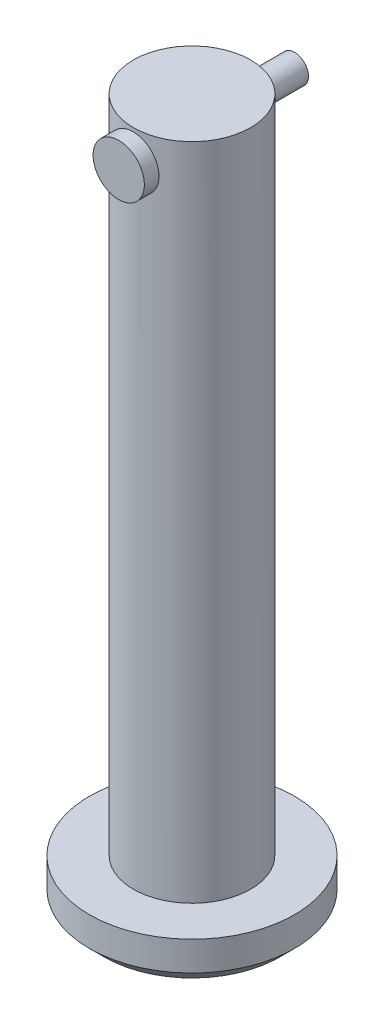
ISO-10303-21;
HEADER;
FILE_DESCRIPTION(('STEP AP214'),'2;1');
FILE_NAME('part.step','',(''),(''),'','','');
FILE_SCHEMA(('AUTOMOTIVE_DESIGN { 1 0 10303 214 1 1 1 1 }'));
ENDSEC;
DATA;
#1=APPLICATION_CONTEXT('core data for automotive mechanical design processes');
#2=APPLICATION_PROTOCOL_DEFINITION('international standard','automotive_design',2000,#1);
#3=PRODUCT_CONTEXT('',#1,'mechanical');
#4=PRODUCT('Part','Part','',(#3));
#5=PRODUCT_RELATED_PRODUCT_CATEGORY('part','',(#4));
#6=PRODUCT_DEFINITION_FORMATION('','',#4);
#7=PRODUCT_DEFINITION_CONTEXT('part definition',#1,'design');
#8=PRODUCT_DEFINITION('design','',#6,#7);
#9=PRODUCT_DEFINITION_SHAPE('','',#8);
#10=(LENGTH_UNIT() NAMED_UNIT(*) SI_UNIT(.MILLI.,.METRE.));
#11=(NAMED_UNIT(*) PLANE_ANGLE_UNIT() SI_UNIT($,.RADIAN.));
#12=(NAMED_UNIT(*) SI_UNIT($,.STERADIAN.) SOLID_ANGLE_UNIT());
#13=UNCERTAINTY_MEASURE_WITH_UNIT(LENGTH_MEASURE(1.E-05),#10,'distance_accuracy_value','');
#14=(GEOMETRIC_REPRESENTATION_CONTEXT(3) GLOBAL_UNCERTAINTY_ASSIGNED_CONTEXT((#13)) GLOBAL_UNIT_ASSIGNED_CONTEXT((#10,
#11,#12)) REPRESENTATION_CONTEXT('',''));
#15=CARTESIAN_POINT('',(0.,0.,0.));
#16=DIRECTION('',(0.,0.,1.));
#17=DIRECTION('',(1.,0.,0.));
#18=AXIS2_PLACEMENT_3D('',#15,#16,#17);
#19=CARTESIAN_POINT('',(0.,43.,-7.));
#20=DIRECTION('',(0.,0.,1.));
#21=DIRECTION('',(1.,0.,0.));
#22=AXIS2_PLACEMENT_3D('',#19,#20,#21);
#23=CYLINDRICAL_SURFACE('',#22,0.95);
#24=CARTESIAN_POINT('',(0.,43.,-7.));
#25=DIRECTION('',(0.,0.,1.));
#26=DIRECTION('',(1.,0.,0.));
#27=AXIS2_PLACEMENT_3D('',#24,#25,#26);
#28=CIRCLE('',#27,0.95);
#29=CARTESIAN_POINT('',(0.95,43.,-7.));
#30=VERTEX_POINT('',#29);
#31=EDGE_CURVE('E11',#30,#30,#28,.T.);
#32=ORIENTED_EDGE('',*,*,#31,.T.);
#33=EDGE_LOOP('',(#32));
#34=FACE_BOUND('',#33,.T.);
#35=CARTESIAN_POINT('',(0.,43.,4.));
#36=DIRECTION('',(0.,0.,1.));
#37=DIRECTION('',(1.,0.,0.));
#38=AXIS2_PLACEMENT_3D('',#35,#36,#37);
#39=CIRCLE('',#38,0.95);
#40=CARTESIAN_POINT('',(0.95,43.,4.));
#41=VERTEX_POINT('',#40);
#42=EDGE_CURVE('E44',#41,#41,#39,.F.);
#43=ORIENTED_EDGE('',*,*,#42,.T.);
#44=EDGE_LOOP('',(#43));
#45=FACE_BOUND('',#44,.T.);
#46=ADVANCED_FACE('F41',(#34,#45),#23,.T.);
#47=CARTESIAN_POINT('',(0.,43.,-7.));
#48=DIRECTION('',(0.,0.,1.));
#49=DIRECTION('',(1.,0.,0.));
#50=AXIS2_PLACEMENT_3D('',#47,#48,#49);
#51=PLANE('',#50);
#52=ORIENTED_EDGE('',*,*,#31,.F.);
#53=EDGE_LOOP('',(#52));
#54=FACE_BOUND('',#53,.T.);
#55=ADVANCED_FACE('F73',(#54),#51,.F.);
#56=CARTESIAN_POINT('',(0.,43.,4.));
#57=DIRECTION('',(0.,0.,1.));
#58=DIRECTION('',(1.,0.,0.));
#59=AXIS2_PLACEMENT_3D('',#56,#57,#58);
#60=CYLINDRICAL_SURFACE('',#59,1.75);
#61=CARTESIAN_POINT('',(0.,43.,4.));
#62=DIRECTION('',(0.,0.,1.));
#63=DIRECTION('',(1.,0.,0.));
#64=AXIS2_PLACEMENT_3D('',#61,#62,#63);
#65=CIRCLE('',#64,1.75);
#66=CARTESIAN_POINT('',(1.75,43.,4.));
#67=VERTEX_POINT('',#66);
#68=EDGE_CURVE('E51',#67,#67,#65,.T.);
#69=ORIENTED_EDGE('',*,*,#68,.T.);
#70=EDGE_LOOP('',(#69));
#71=FACE_BOUND('',#70,.T.);
#72=CARTESIAN_POINT('',(0.,43.,5.));
#73=DIRECTION('',(0.,0.,1.));
#74=DIRECTION('',(1.,0.,0.));
#75=AXIS2_PLACEMENT_3D('',#72,#73,#74);
#76=CIRCLE('',#75,1.75);
#77=CARTESIAN_POINT('',(1.75,43.,5.));
#78=VERTEX_POINT('',#77);
#79=EDGE_CURVE('E53',#78,#78,#76,.T.);
#80=ORIENTED_EDGE('',*,*,#79,.F.);
#81=EDGE_LOOP('',(#80));
#82=FACE_BOUND('',#81,.T.);
#83=ADVANCED_FACE('F59',(#71,#82),#60,.T.);
#84=CARTESIAN_POINT('',(0.,43.,4.));
#85=DIRECTION('',(0.,0.,1.));
#86=DIRECTION('',(1.,0.,0.));
#87=AXIS2_PLACEMENT_3D('',#84,#85,#86);
#88=PLANE('',#87);
#89=ORIENTED_EDGE('',*,*,#42,.F.);
#90=EDGE_LOOP('',(#89));
#91=FACE_BOUND('',#90,.T.);
#92=ORIENTED_EDGE('',*,*,#68,.F.);
#93=EDGE_LOOP('',(#92));
#94=FACE_BOUND('',#93,.T.);
#95=ADVANCED_FACE('F62',(#91,#94),#88,.F.);
#96=CARTESIAN_POINT('',(0.,43.,5.));
#97=DIRECTION('',(0.,0.,1.));
#98=DIRECTION('',(1.,0.,0.));
#99=AXIS2_PLACEMENT_3D('',#96,#97,#98);
#100=PLANE('',#99);
#101=ORIENTED_EDGE('',*,*,#79,.T.);
#102=EDGE_LOOP('',(#101));
#103=FACE_BOUND('',#102,.T.);
#104=ADVANCED_FACE('F64',(#103),#100,.T.);
#105=CLOSED_SHELL('',(#46,#55,#83,#95,#104));
#106=MANIFOLD_SOLID_BREP('B2',#105);
#107=CARTESIAN_POINT('',(0.,45.,0.));
#108=DIRECTION('',(0.,-1.,0.));
#109=DIRECTION('',(0.,0.,-1.));
#110=AXIS2_PLACEMENT_3D('',#107,#108,#109);
#111=CYLINDRICAL_SURFACE('',#110,4.);
#112=CARTESIAN_POINT('',(0.,45.,0.));
#113=DIRECTION('',(0.,1.,0.));
#114=DIRECTION('',(0.,0.,1.));
#115=AXIS2_PLACEMENT_3D('',#112,#113,#114);
#116=CIRCLE('',#115,4.);
#117=CARTESIAN_POINT('',(0.,45.,4.));
#118=VERTEX_POINT('',#117);
#119=EDGE_CURVE('E131',#118,#118,#116,.T.);
#120=ORIENTED_EDGE('',*,*,#119,.F.);
#121=EDGE_LOOP('',(#120));
#122=FACE_BOUND('',#121,.T.);
#123=CARTESIAN_POINT('',(0.,0.,0.));
#124=DIRECTION('',(0.,-1.,0.));
#125=DIRECTION('',(0.,0.,-1.));
#126=AXIS2_PLACEMENT_3D('',#123,#124,#125);
#127=CIRCLE('',#126,4.);
#128=CARTESIAN_POINT('',(0.,0.,-4.));
#129=VERTEX_POINT('',#128);
#130=EDGE_CURVE('E165',#129,#129,#127,.T.);
#131=ORIENTED_EDGE('',*,*,#130,.F.);
#132=EDGE_LOOP('',(#131));
#133=FACE_BOUND('',#132,.T.);
#134=CARTESIAN_POINT('',(-1.,43.,3.87298334620742));
#135=CARTESIAN_POINT('',(-0.9999984314387,42.9447796996432,3.87298440057185));
#136=CARTESIAN_POINT('',(-0.99541049820807,42.8895420405686,3.87417722499278));
#137=CARTESIAN_POINT('',(-0.977209250194448,42.7806529687674,3.87880744892249));
#138=CARTESIAN_POINT('',(-0.963590682698079,42.72700249822,3.8822461547418));
#139=CARTESIAN_POINT('',(-0.927796479849635,42.6228785847122,3.89095489813012));
#140=CARTESIAN_POINT('',(-0.905631891140941,42.5724011378422,3.8962225706936));
#141=CARTESIAN_POINT('',(-0.853408456505403,42.4758756589875,3.90799276818327));
#142=CARTESIAN_POINT('',(-0.823349275424503,42.4298278151688,3.91449534553241));
#143=CARTESIAN_POINT('',(-0.755483370924518,42.3424553418942,3.92816286540368));
#144=CARTESIAN_POINT('',(-0.717534755081558,42.3012425598597,3.93533839048709));
#145=CARTESIAN_POINT('',(-0.635272825640328,42.2256954422561,3.94945150206622));
#146=CARTESIAN_POINT('',(-0.59095891767214,42.1913617497514,3.95638906626691));
#147=CARTESIAN_POINT('',(-0.496458080431566,42.1300898129474,3.96936166208095));
#148=CARTESIAN_POINT('',(-0.446197830478045,42.1032614447354,3.975382749602));
#149=CARTESIAN_POINT('',(-0.341705273717112,42.0584761423388,3.9857232477043));
#150=CARTESIAN_POINT('',(-0.28747355431678,42.0405178992338,3.99004290933747));
#151=CARTESIAN_POINT('',(-0.177743503501667,42.0143408661686,3.99641903539262));
#152=CARTESIAN_POINT('',(-0.122293087819594,42.0059321422694,3.99851957537723));
#153=CARTESIAN_POINT('',(-0.0107315277051117,41.9984966482898,4.00037437642922));
#154=CARTESIAN_POINT('',(0.045379517815224,41.9994684911162,4.00012898438682));
#155=CARTESIAN_POINT('',(0.155352247172384,42.0106299401001,3.99735237981413));
#156=CARTESIAN_POINT('',(0.209236215601063,42.0206145300215,3.99487200936349));
#157=CARTESIAN_POINT('',(0.314538247413682,42.0491885080194,3.98796334609942));
#158=CARTESIAN_POINT('',(0.365956179370435,42.067778354151,3.98353494959376));
#159=CARTESIAN_POINT('',(0.465406703501804,42.1132010282748,3.97315003880358));
#160=CARTESIAN_POINT('',(0.513404509766501,42.1401068178647,3.96718007878021));
#161=CARTESIAN_POINT('',(0.604275622340485,42.2013422716465,3.9543596152386));
#162=CARTESIAN_POINT('',(0.647148035085502,42.2356732274242,3.94750895860996));
#163=CARTESIAN_POINT('',(0.727774035084955,42.3118834967929,3.93345485507808));
#164=CARTESIAN_POINT('',(0.765357679075198,42.3539419569391,3.92624687810367));
#165=CARTESIAN_POINT('',(0.832976375963017,42.4438399894161,3.91246017406683));
#166=CARTESIAN_POINT('',(0.863011076046014,42.4916798317964,3.90588147642388));
#167=CARTESIAN_POINT('',(0.914788129022598,42.5921160136596,3.89408198732659));
#168=CARTESIAN_POINT('',(0.936489566970493,42.6447342921253,3.88886793490288));
#169=CARTESIAN_POINT('',(0.970685620636343,42.7530341872306,3.88047456055983));
#170=CARTESIAN_POINT('',(0.983182206552911,42.8087151455933,3.87729480324087));
#171=CARTESIAN_POINT('',(0.998331855466071,42.9199838006092,3.87342142415656));
#172=CARTESIAN_POINT('',(1.00123618956785,42.9755351173318,3.87266435637459));
#173=CARTESIAN_POINT('',(0.99780679620622,43.0863287746313,3.87354937392416));
#174=CARTESIAN_POINT('',(0.991473919139521,43.1415711431805,3.87519123840506));
#175=CARTESIAN_POINT('',(0.969970185575067,43.2492457059819,3.88062832781824));
#176=CARTESIAN_POINT('',(0.954945627312701,43.3017090906283,3.8843878809375));
#177=CARTESIAN_POINT('',(0.916647232668251,43.4033725831407,3.89360287308385));
#178=CARTESIAN_POINT('',(0.89337241908502,43.4525723036221,3.89905851299445));
#179=CARTESIAN_POINT('',(0.838708267174625,43.5473765111469,3.91118454837305));
#180=CARTESIAN_POINT('',(0.807168701534253,43.5928915360172,3.91787667442657));
#181=CARTESIAN_POINT('',(0.737060292934457,43.6780753451205,3.93166833228686));
#182=CARTESIAN_POINT('',(0.698490294805439,43.71774316666,3.93876793091388));
#183=CARTESIAN_POINT('',(0.614262720984724,43.7911244170284,3.95278961212643));
#184=CARTESIAN_POINT('',(0.568451952531592,43.8246640250195,3.95970280824734));
#185=CARTESIAN_POINT('',(0.471702682694676,43.8835743467805,3.97238886645494));
#186=CARTESIAN_POINT('',(0.420764448957593,43.9089454866433,3.97816178801584));
#187=CARTESIAN_POINT('',(0.315558201731094,43.9505784138112,3.98788046295326));
#188=CARTESIAN_POINT('',(0.261317381027885,43.9669057137516,3.99183932008964));
#189=CARTESIAN_POINT('',(0.150749760318812,43.9901841338434,3.99754117358315));
#190=CARTESIAN_POINT('',(0.0944233650412474,43.9971370634956,3.99928459757363));
#191=CARTESIAN_POINT('',(-0.0170835264433232,44.0013675895755,4.00034169408811));
#192=CARTESIAN_POINT('',(-0.0722538269660304,43.9989017090954,3.99971978880008));
#193=CARTESIAN_POINT('',(-0.181367496414737,43.9849521727057,3.99625896457423));
#194=CARTESIAN_POINT('',(-0.235310901780884,43.9734687849869,3.99342011157094));
#195=CARTESIAN_POINT('',(-0.340171035644814,43.9419477802291,3.98585432853963));
#196=CARTESIAN_POINT('',(-0.391102494581017,43.9219565466854,3.98113764502669));
#197=CARTESIAN_POINT('',(-0.488917053041466,43.8740294209807,3.97031288913382));
#198=CARTESIAN_POINT('',(-0.535799641265048,43.8460925273304,3.96420464137727));
#199=CARTESIAN_POINT('',(-0.625401928423897,43.7822847660029,3.95107249681342));
#200=CARTESIAN_POINT('',(-0.667994988300584,43.7462398570926,3.94403016945647));
#201=CARTESIAN_POINT('',(-0.74661502027125,43.6675771480262,3.92990649053207));
#202=CARTESIAN_POINT('',(-0.782640325068177,43.6249576839021,3.92282512952424));
#203=CARTESIAN_POINT('',(-0.847762026479239,43.5333985857987,3.90927475860683));
#204=CARTESIAN_POINT('',(-0.876716619446591,43.4843558765875,3.90281963730391));
#205=CARTESIAN_POINT('',(-0.92592689661562,43.3819445100772,3.8914395555011));
#206=CARTESIAN_POINT('',(-0.946188909759556,43.3285790338927,3.88651348244814));
#207=CARTESIAN_POINT('',(-0.974422528565572,43.2294229881737,3.87951908741315));
#208=CARTESIAN_POINT('',(-0.983993170595829,43.1841068356176,3.87708663005761));
#209=CARTESIAN_POINT('',(-0.996782292572819,43.0925311309985,3.87381838580358));
#210=CARTESIAN_POINT('',(-1.00000131437052,43.0462716597494,3.87298246270638));
#211=CARTESIAN_POINT('',(-1.,43.,3.87298334620742));
#212=B_SPLINE_CURVE_WITH_KNOTS('',3,(#134,#135,#136,#137,#138,#139,#140,#141,#142,#143,#144,
#145,#146,#147,#148,#149,#150,#151,#152,#153,#154,#155,#156,#157,#158,#159,#160,#161,#162,#163,
#164,#165,#166,#167,#168,#169,#170,#171,#172,#173,#174,#175,#176,#177,#178,#179,#180,#181,#182,
#183,#184,#185,#186,#187,#188,#189,#190,#191,#192,#193,#194,#195,#196,#197,#198,#199,#200,#201,
#202,#203,#204,#205,#206,#207,#208,#209,#210,#211),.UNSPECIFIED.,.T.,.F.,(4,2,2,2,2,2,2,2,2,2,2,
2,2,2,2,2,2,2,2,2,2,2,2,2,2,2,2,2,2,2,2,2,2,2,2,2,2,2,4),(0.,0.165490976675224,
0.331078296534208,0.496452290829168,0.66183330698466,0.830495816734648,0.99917408588221,
1.17020598555442,1.34121263935111,1.50875500394413,1.67627259462682,1.84007305071853,
2.00388222686189,2.16917149698052,2.33448954183839,2.50428186625039,2.67408212476195,
2.84470572799636,3.01529280048094,3.18137429900961,3.34744050869795,3.51078961999957,
3.67415808564842,3.84073138339938,4.00733207550293,4.17810132382402,4.34886166284096,
4.51836829119046,4.6878421955989,4.85273378447257,5.01762046947067,5.18161950620159,
5.34563922291503,5.51358838629103,5.68158012622478,5.85270590910145,6.02370688542922,
6.16239130867207,6.30106390036083),.UNSPECIFIED.);
#213=CARTESIAN_POINT('',(-1.,43.,3.87298334620742));
#214=VERTEX_POINT('',#213);
#215=EDGE_CURVE('E134',#214,#214,#212,.T.);
#216=ORIENTED_EDGE('',*,*,#215,.F.);
#217=EDGE_LOOP('',(#216));
#218=FACE_BOUND('',#217,.T.);
#219=CARTESIAN_POINT('',(0.,44.,-4.));
#220=CARTESIAN_POINT('',(0.0552507257798211,43.9999984495079,-3.99999906578675));
#221=CARTESIAN_POINT('',(0.110518771887176,43.9954056328175,-3.99884385421219));
#222=CARTESIAN_POINT('',(0.219470882513689,43.977183232462,-3.99434742553261));
#223=CARTESIAN_POINT('',(0.27315403124716,43.9635485269748,-3.99100496946646));
#224=CARTESIAN_POINT('',(0.37734724812172,43.9277071643586,-3.98250417554693));
#225=CARTESIAN_POINT('',(0.427861042286672,43.9055108008565,-3.97734801894724));
#226=CARTESIAN_POINT('',(0.524448087936288,43.8532124066368,-3.96576895871729));
#227=CARTESIAN_POINT('',(0.570521189565842,43.823110109254,-3.95934601236034));
#228=CARTESIAN_POINT('',(0.657867951533948,43.7551994735639,-3.94578275727867));
#229=CARTESIAN_POINT('',(0.699037126707383,43.7172589500272,-3.93863138099022));
#230=CARTESIAN_POINT('',(0.774499284802205,43.635031863394,-3.92449080078353));
#231=CARTESIAN_POINT('',(0.808791491299426,43.5907445847023,-3.91750161525566));
#232=CARTESIAN_POINT('',(0.870017695199358,43.4962698488417,-3.9043651713314));
#233=CARTESIAN_POINT('',(0.896834810616906,43.4460045127931,-3.89823196313737));
#234=CARTESIAN_POINT('',(0.941597939033685,43.3415010588944,-3.88766329874815));
#235=CARTESIAN_POINT('',(0.959545370292889,43.2872635777828,-3.88322757115192));
#236=CARTESIAN_POINT('',(0.985703224536195,43.1775043345317,-3.87666984478367));
#237=CARTESIAN_POINT('',(0.994101512222227,43.1220300693001,-3.87450327383617));
#238=CARTESIAN_POINT('',(1.00150785004524,43.0104209539907,-3.87259575025161));
#239=CARTESIAN_POINT('',(1.00051742787865,42.9542862128676,-3.87285440299096));
#240=CARTESIAN_POINT('',(0.98932434975952,42.8443894615037,-3.87572803664412));
#241=CARTESIAN_POINT('',(0.979345560127012,42.7906029190233,-3.87828575334586));
#242=CARTESIAN_POINT('',(0.95081612460207,42.6854926327258,-3.88537806450989));
#243=CARTESIAN_POINT('',(0.932264868046281,42.6341690646473,-3.88991279980464));
#244=CARTESIAN_POINT('',(0.886926318624768,42.5348413224986,-3.90050075936124));
#245=CARTESIAN_POINT('',(0.860057778155272,42.4868758854736,-3.90656884979614));
#246=CARTESIAN_POINT('',(0.798904184009968,42.3960541934954,-3.91953140564257));
#247=CARTESIAN_POINT('',(0.764617832539224,42.3531988346218,-3.9264260155649));
#248=CARTESIAN_POINT('',(0.688442283120809,42.2725309228704,-3.94050587026521));
#249=CARTESIAN_POINT('',(0.646364172110569,42.2348970066258,-3.94769379651981));
#250=CARTESIAN_POINT('',(0.556407945002461,42.1671858383574,-3.96137310385857));
#251=CARTESIAN_POINT('',(0.50852965180529,42.1371088171576,-3.96786446366277));
#252=CARTESIAN_POINT('',(0.408077259120922,42.0852996091837,-3.97945154729455));
#253=CARTESIAN_POINT('',(0.35548759547241,42.0635964398304,-3.9845424008515));
#254=CARTESIAN_POINT('',(0.247250672095251,42.0293884628603,-3.99271944660946));
#255=CARTESIAN_POINT('',(0.191603999433652,42.0168818957212,-3.99580602226187));
#256=CARTESIAN_POINT('',(0.0803599802600136,42.0016949562941,-3.9995699951425));
#257=CARTESIAN_POINT('',(0.0247978133254691,41.9987713159498,-4.00030702338852));
#258=CARTESIAN_POINT('',(-0.0860219165343424,42.0021660013703,-3.999458698763));
#259=CARTESIAN_POINT('',(-0.141279506429733,42.0084834951994,-3.99787355494564));
#260=CARTESIAN_POINT('',(-0.249076179184331,42.0299806055942,-3.99259720751571));
#261=CARTESIAN_POINT('',(-0.30164341264584,42.0450275089847,-3.98893756123874));
#262=CARTESIAN_POINT('',(-0.403504861635011,42.0834047226856,-3.97992471089423));
#263=CARTESIAN_POINT('',(-0.452798746021759,42.1067358695421,-3.97457133579928));
#264=CARTESIAN_POINT('',(-0.5476820896199,42.1614907525831,-3.96262205284207));
#265=CARTESIAN_POINT('',(-0.593190294557221,42.1930507415978,-3.95600578244621));
#266=CARTESIAN_POINT('',(-0.678351075762165,42.2631932725313,-3.94229672791613));
#267=CARTESIAN_POINT('',(-0.71800263931534,42.3017770264113,-3.93520386167803));
#268=CARTESIAN_POINT('',(-0.791327045381822,42.3860013072296,-3.92112637973847));
#269=CARTESIAN_POINT('',(-0.824829245081355,42.4317918020016,-3.91414869458187));
#270=CARTESIAN_POINT('',(-0.883673839341799,42.5284884229771,-3.90128585584826));
#271=CARTESIAN_POINT('',(-0.909016596105293,42.5793943219732,-3.89540065378017));
#272=CARTESIAN_POINT('',(-0.950634280406197,42.684603814942,-3.88545396489777));
#273=CARTESIAN_POINT('',(-0.966962931102711,42.7388850855627,-3.88138170194604));
#274=CARTESIAN_POINT('',(-0.990230439969186,42.8495397585927,-3.87551162726789));
#275=CARTESIAN_POINT('',(-0.997171351652439,42.9059127006883,-3.87371331813291));
#276=CARTESIAN_POINT('',(-1.00135906022266,43.0174140159035,-3.87263267469304));
#277=CARTESIAN_POINT('',(-0.99887859852008,43.0725316234165,-3.87327955152176));
#278=CARTESIAN_POINT('',(-0.984918185541911,43.1815359257787,-3.87685272671895));
#279=CARTESIAN_POINT('',(-0.973438415124512,43.2354226453424,-3.87977897927904));
#280=CARTESIAN_POINT('',(-0.941954212961862,43.3401389727103,-3.88754173788482));
#281=CARTESIAN_POINT('',(-0.922000936453583,43.3909848701601,-3.89236676824206));
#282=CARTESIAN_POINT('',(-0.874176609070046,43.4886435884758,-3.90338503816552));
#283=CARTESIAN_POINT('',(-0.846304460022792,43.5354558487913,-3.90957846747182));
#284=CARTESIAN_POINT('',(-0.782578499091425,43.6250364193347,-3.92283756175675));
#285=CARTESIAN_POINT('',(-0.746535441941504,43.6676673822826,-3.92992176554505));
#286=CARTESIAN_POINT('',(-0.667859580793158,43.7463646965303,-3.94405351497524));
#287=CARTESIAN_POINT('',(-0.625225214174097,43.782429486742,-3.95110105151373));
#288=CARTESIAN_POINT('',(-0.533645057801727,43.8476075390431,-3.96451770431775));
#289=CARTESIAN_POINT('',(-0.484598948210926,43.876583075781,-3.97087222243912));
#290=CARTESIAN_POINT('',(-0.382177373006986,43.9258316419604,-3.98203283316746));
#291=CARTESIAN_POINT('',(-0.32880504229116,43.946110907099,-3.98684003466521));
#292=CARTESIAN_POINT('',(-0.229606835495647,43.9743812202198,-3.99365373043694));
#293=CARTESIAN_POINT('',(-0.184253447272045,43.983967495369,-3.9960172336846));
#294=CARTESIAN_POINT('',(-0.0926040476908554,43.996777295748,-3.99919070154632));
#295=CARTESIAN_POINT('',(-0.0463081074950776,44.0000012995369,-4.00000078300596));
#296=CARTESIAN_POINT('',(0.,44.,-4.));
#297=B_SPLINE_CURVE_WITH_KNOTS('',3,(#219,#220,#221,#222,#223,#224,#225,#226,#227,#228,#229,
#230,#231,#232,#233,#234,#235,#236,#237,#238,#239,#240,#241,#242,#243,#244,#245,#246,#247,#248,
#249,#250,#251,#252,#253,#254,#255,#256,#257,#258,#259,#260,#261,#262,#263,#264,#265,#266,#267,
#268,#269,#270,#271,#272,#273,#274,#275,#276,#277,#278,#279,#280,#281,#282,#283,#284,#285,#286,
#287,#288,#289,#290,#291,#292,#293,#294,#295,#296),.UNSPECIFIED.,.T.,.F.,(4,2,2,2,2,2,2,2,2,2,2,
2,2,2,2,2,2,2,2,2,2,2,2,2,2,2,2,2,2,2,2,2,2,2,2,2,2,2,4),(0.,0.165582474981261,
0.331258825175935,0.496736601524074,0.662219960112887,0.830762902914266,0.999324863867081,
1.17039098363872,1.34142974112912,1.50904196732954,1.67662692075132,1.84014998004679,
2.0036846897736,2.16887018582587,2.33408460557443,2.50401000646014,2.67394059705499,
2.84445486006077,3.01493649125763,3.18105539299518,3.34715934075163,3.51080183009359,
3.67446084881528,3.84102391710235,4.0076157533868,4.17829672802984,4.34897012499672,
4.51861503076025,4.68822282168272,4.85295853599076,5.0176909397069,5.18144267039632,
5.34521712091268,5.51326384273274,5.68135046513612,5.85248123666392,6.02348909214234,
6.16228161961433,6.30106370695361),.UNSPECIFIED.);
#298=CARTESIAN_POINT('',(0.,44.,-4.));
#299=VERTEX_POINT('',#298);
#300=EDGE_CURVE('E119',#299,#299,#297,.T.);
#301=ORIENTED_EDGE('',*,*,#300,.F.);
#302=EDGE_LOOP('',(#301));
#303=FACE_BOUND('',#302,.T.);
#304=ADVANCED_FACE('F115',(#122,#133,#218,#303),#111,.T.);
#305=CARTESIAN_POINT('',(0.,45.,0.));
#306=DIRECTION('',(0.,1.,0.));
#307=DIRECTION('',(0.,0.,1.));
#308=AXIS2_PLACEMENT_3D('',#305,#306,#307);
#309=PLANE('',#308);
#310=ORIENTED_EDGE('',*,*,#119,.T.);
#311=EDGE_LOOP('',(#310));
#312=FACE_BOUND('',#311,.T.);
#313=ADVANCED_FACE('F156',(#312),#309,.T.);
#314=CARTESIAN_POINT('',(0.,-3.,0.));
#315=DIRECTION('',(0.,1.,0.));
#316=DIRECTION('',(0.,0.,1.));
#317=AXIS2_PLACEMENT_3D('',#314,#315,#316);
#318=CYLINDRICAL_SURFACE('',#317,7.);
#319=CARTESIAN_POINT('',(0.,-2.,0.));
#320=DIRECTION('',(0.,-1.,0.));
#321=DIRECTION('',(0.,0.,-1.));
#322=AXIS2_PLACEMENT_3D('',#319,#320,#321);
#323=CIRCLE('',#322,7.);
#324=CARTESIAN_POINT('',(0.,-2.,-7.));
#325=VERTEX_POINT('',#324);
#326=EDGE_CURVE('E40',#325,#325,#323,.F.);
#327=ORIENTED_EDGE('',*,*,#326,.T.);
#328=EDGE_LOOP('',(#327));
#329=FACE_BOUND('',#328,.T.);
#330=CARTESIAN_POINT('',(0.,0.,0.));
#331=DIRECTION('',(0.,-1.,0.));
#332=DIRECTION('',(0.,0.,-1.));
#333=AXIS2_PLACEMENT_3D('',#330,#331,#332);
#334=CIRCLE('',#333,7.);
#335=CARTESIAN_POINT('',(0.,0.,-7.));
#336=VERTEX_POINT('',#335);
#337=EDGE_CURVE('E167',#336,#336,#334,.T.);
#338=ORIENTED_EDGE('',*,*,#337,.T.);
#339=EDGE_LOOP('',(#338));
#340=FACE_BOUND('',#339,.T.);
#341=ADVANCED_FACE('F150',(#329,#340),#318,.T.);
#342=CARTESIAN_POINT('',(0.,-3.,0.));
#343=DIRECTION('',(0.,-1.,0.));
#344=DIRECTION('',(0.,0.,-1.));
#345=AXIS2_PLACEMENT_3D('',#342,#343,#344);
#346=PLANE('',#345);
#347=CARTESIAN_POINT('',(0.,-3.,0.));
#348=DIRECTION('',(0.,-1.,0.));
#349=DIRECTION('',(0.,0.,-1.));
#350=AXIS2_PLACEMENT_3D('',#347,#348,#349);
#351=CIRCLE('',#350,6.00000000000001);
#352=CARTESIAN_POINT('',(0.,-3.,-6.00000000000001));
#353=VERTEX_POINT('',#352);
#354=EDGE_CURVE('E126',#353,#353,#351,.T.);
#355=ORIENTED_EDGE('',*,*,#354,.T.);
#356=EDGE_LOOP('',(#355));
#357=FACE_BOUND('',#356,.T.);
#358=ADVANCED_FACE('F145',(#357),#346,.T.);
#359=CARTESIAN_POINT('',(0.,0.,0.));
#360=DIRECTION('',(0.,-1.,0.));
#361=DIRECTION('',(0.,0.,-1.));
#362=AXIS2_PLACEMENT_3D('',#359,#360,#361);
#363=PLANE('',#362);
#364=ORIENTED_EDGE('',*,*,#130,.T.);
#365=EDGE_LOOP('',(#364));
#366=FACE_BOUND('',#365,.T.);
#367=ORIENTED_EDGE('',*,*,#337,.F.);
#368=EDGE_LOOP('',(#367));
#369=FACE_BOUND('',#368,.T.);
#370=ADVANCED_FACE('F149',(#366,#369),#363,.F.);
#371=CARTESIAN_POINT('',(0.,-3.,0.));
#372=DIRECTION('',(0.,1.,0.));
#373=DIRECTION('',(0.,0.,1.));
#374=AXIS2_PLACEMENT_3D('',#371,#372,#373);
#375=CONICAL_SURFACE('',#374,6.00000000000001,0.785398163397447);
#376=ORIENTED_EDGE('',*,*,#326,.F.);
#377=EDGE_LOOP('',(#376));
#378=FACE_BOUND('',#377,.T.);
#379=ORIENTED_EDGE('',*,*,#354,.F.);
#380=EDGE_LOOP('',(#379));
#381=FACE_BOUND('',#380,.T.);
#382=ADVANCED_FACE('F117',(#378,#381),#375,.T.);
#383=CARTESIAN_POINT('',(0.,43.,10.));
#384=DIRECTION('',(0.,0.,-1.));
#385=DIRECTION('',(-1.,0.,0.));
#386=AXIS2_PLACEMENT_3D('',#383,#384,#385);
#387=CYLINDRICAL_SURFACE('',#386,1.);
#388=ORIENTED_EDGE('',*,*,#215,.T.);
#389=EDGE_LOOP('',(#388));
#390=FACE_BOUND('',#389,.T.);
#391=ORIENTED_EDGE('',*,*,#300,.T.);
#392=EDGE_LOOP('',(#391));
#393=FACE_BOUND('',#392,.T.);
#394=ADVANCED_FACE('F140',(#390,#393),#387,.F.);
#395=CLOSED_SHELL('',(#304,#313,#341,#358,#370,#382,#394));
#396=MANIFOLD_SOLID_BREP('B6',#395);
#397=ADVANCED_BREP_SHAPE_REPRESENTATION('',(#18,#106,#396),#14);
#398=SHAPE_DEFINITION_REPRESENTATION(#9,#397);
ENDSEC;
END-ISO-10303-21;
